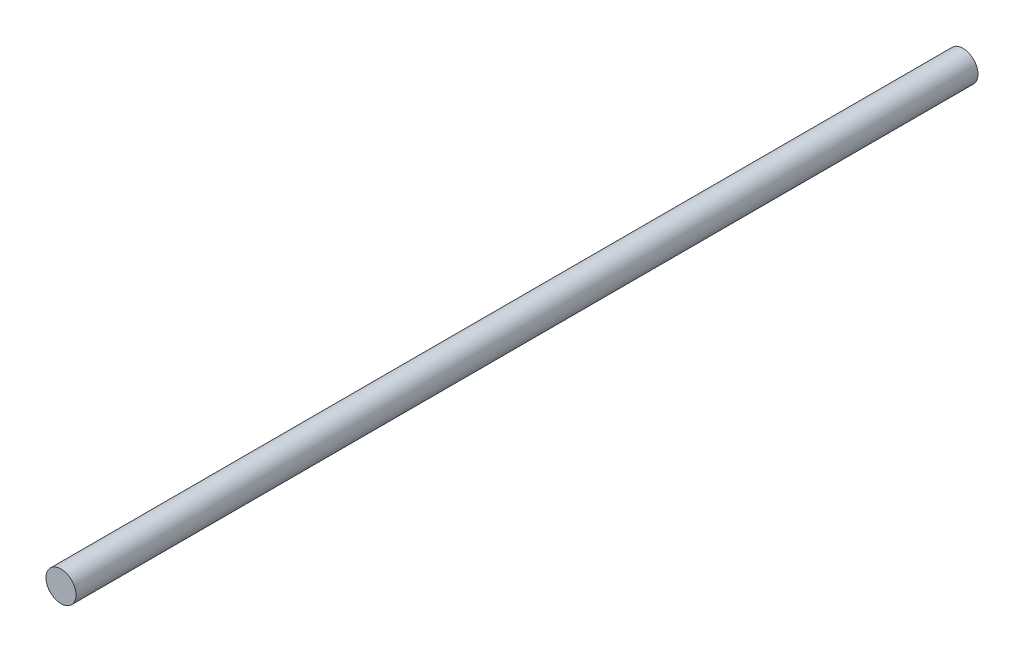
ISO-10303-21;
HEADER;
FILE_DESCRIPTION(('STEP AP214'),'2;1');
FILE_NAME('part.step','',(''),(''),'','','');
FILE_SCHEMA(('AUTOMOTIVE_DESIGN { 1 0 10303 214 1 1 1 1 }'));
ENDSEC;
DATA;
#1=APPLICATION_CONTEXT('core data for automotive mechanical design processes');
#2=APPLICATION_PROTOCOL_DEFINITION('international standard','automotive_design',2000,#1);
#3=PRODUCT_CONTEXT('',#1,'mechanical');
#4=PRODUCT('Part','Part','',(#3));
#5=PRODUCT_RELATED_PRODUCT_CATEGORY('part','',(#4));
#6=PRODUCT_DEFINITION_FORMATION('','',#4);
#7=PRODUCT_DEFINITION_CONTEXT('part definition',#1,'design');
#8=PRODUCT_DEFINITION('design','',#6,#7);
#9=PRODUCT_DEFINITION_SHAPE('','',#8);
#10=(LENGTH_UNIT() NAMED_UNIT(*) SI_UNIT(.MILLI.,.METRE.));
#11=(NAMED_UNIT(*) PLANE_ANGLE_UNIT() SI_UNIT($,.RADIAN.));
#12=(NAMED_UNIT(*) SI_UNIT($,.STERADIAN.) SOLID_ANGLE_UNIT());
#13=UNCERTAINTY_MEASURE_WITH_UNIT(LENGTH_MEASURE(1.E-05),#10,'distance_accuracy_value','');
#14=(GEOMETRIC_REPRESENTATION_CONTEXT(3) GLOBAL_UNCERTAINTY_ASSIGNED_CONTEXT((#13)) GLOBAL_UNIT_ASSIGNED_CONTEXT((#10,
#11,#12)) REPRESENTATION_CONTEXT('',''));
#15=CARTESIAN_POINT('',(0.,0.,0.));
#16=DIRECTION('',(0.,0.,1.));
#17=DIRECTION('',(1.,0.,0.));
#18=AXIS2_PLACEMENT_3D('',#15,#16,#17);
#19=CARTESIAN_POINT('',(0.,0.,300.));
#20=DIRECTION('',(0.,0.,-1.));
#21=DIRECTION('',(-1.,0.,0.));
#22=AXIS2_PLACEMENT_3D('',#19,#20,#21);
#23=CYLINDRICAL_SURFACE('',#22,5.);
#24=CARTESIAN_POINT('',(0.,0.,300.));
#25=DIRECTION('',(0.,0.,1.));
#26=DIRECTION('',(1.,0.,0.));
#27=AXIS2_PLACEMENT_3D('',#24,#25,#26);
#28=CIRCLE('',#27,5.);
#29=CARTESIAN_POINT('',(5.,0.,300.));
#30=VERTEX_POINT('',#29);
#31=EDGE_CURVE('E10',#30,#30,#28,.T.);
#32=ORIENTED_EDGE('',*,*,#31,.F.);
#33=EDGE_LOOP('',(#32));
#34=FACE_BOUND('',#33,.T.);
#35=CARTESIAN_POINT('',(0.,0.,0.));
#36=DIRECTION('',(0.,0.,1.));
#37=DIRECTION('',(1.,0.,0.));
#38=AXIS2_PLACEMENT_3D('',#35,#36,#37);
#39=CIRCLE('',#38,5.);
#40=CARTESIAN_POINT('',(5.,0.,0.));
#41=VERTEX_POINT('',#40);
#42=EDGE_CURVE('E40',#41,#41,#39,.T.);
#43=ORIENTED_EDGE('',*,*,#42,.T.);
#44=EDGE_LOOP('',(#43));
#45=FACE_BOUND('',#44,.T.);
#46=ADVANCED_FACE('F37',(#34,#45),#23,.T.);
#47=CARTESIAN_POINT('',(0.,0.,300.));
#48=DIRECTION('',(0.,0.,1.));
#49=DIRECTION('',(1.,0.,0.));
#50=AXIS2_PLACEMENT_3D('',#47,#48,#49);
#51=PLANE('',#50);
#52=ORIENTED_EDGE('',*,*,#31,.T.);
#53=EDGE_LOOP('',(#52));
#54=FACE_BOUND('',#53,.T.);
#55=ADVANCED_FACE('F54',(#54),#51,.T.);
#56=CARTESIAN_POINT('',(0.,0.,0.));
#57=DIRECTION('',(0.,0.,1.));
#58=DIRECTION('',(1.,0.,0.));
#59=AXIS2_PLACEMENT_3D('',#56,#57,#58);
#60=PLANE('',#59);
#61=ORIENTED_EDGE('',*,*,#42,.F.);
#62=EDGE_LOOP('',(#61));
#63=FACE_BOUND('',#62,.T.);
#64=ADVANCED_FACE('F52',(#63),#60,.F.);
#65=CLOSED_SHELL('',(#46,#55,#64));
#66=MANIFOLD_SOLID_BREP('B2',#65);
#67=ADVANCED_BREP_SHAPE_REPRESENTATION('',(#18,#66),#14);
#68=SHAPE_DEFINITION_REPRESENTATION(#9,#67);
ENDSEC;
END-ISO-10303-21;
